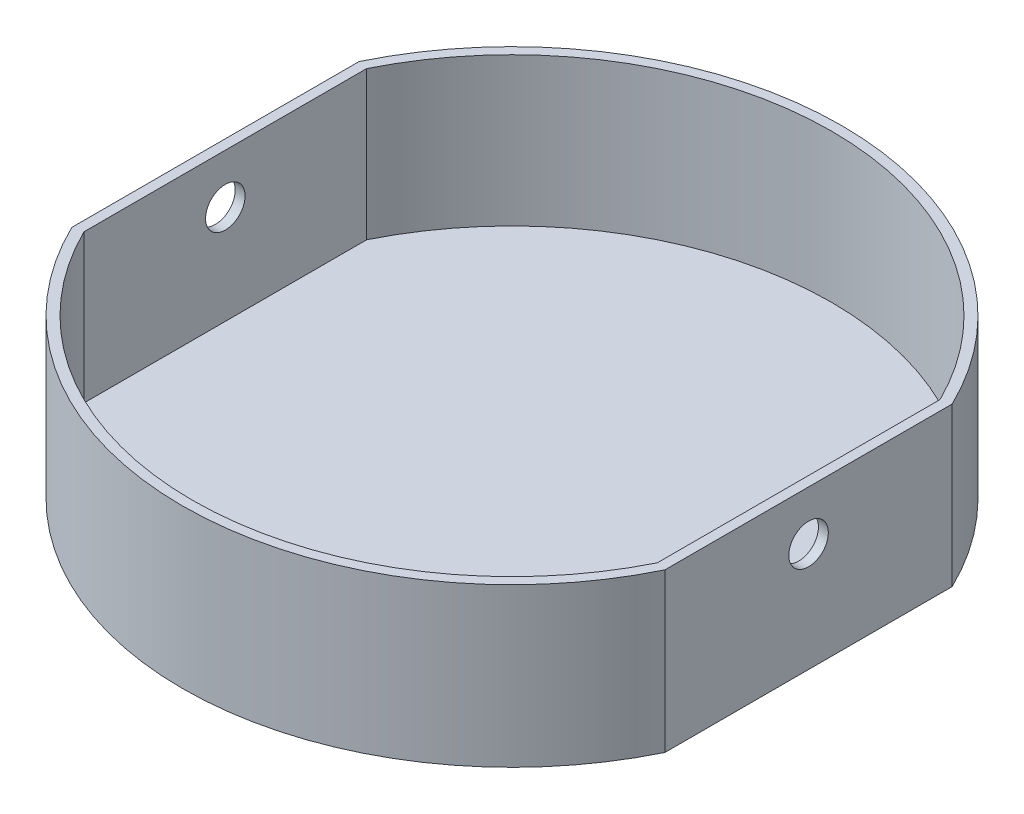
ISO-10303-21;
HEADER;
FILE_DESCRIPTION(('STEP AP214'),'2;1');
FILE_NAME('part.step','',(''),(''),'','','');
FILE_SCHEMA(('AUTOMOTIVE_DESIGN { 1 0 10303 214 1 1 1 1 }'));
ENDSEC;
DATA;
#1=APPLICATION_CONTEXT('core data for automotive mechanical design processes');
#2=APPLICATION_PROTOCOL_DEFINITION('international standard','automotive_design',2000,#1);
#3=PRODUCT_CONTEXT('',#1,'mechanical');
#4=PRODUCT('Part','Part','',(#3));
#5=PRODUCT_RELATED_PRODUCT_CATEGORY('part','',(#4));
#6=PRODUCT_DEFINITION_FORMATION('','',#4);
#7=PRODUCT_DEFINITION_CONTEXT('part definition',#1,'design');
#8=PRODUCT_DEFINITION('design','',#6,#7);
#9=PRODUCT_DEFINITION_SHAPE('','',#8);
#10=(LENGTH_UNIT() NAMED_UNIT(*) SI_UNIT(.MILLI.,.METRE.));
#11=(NAMED_UNIT(*) PLANE_ANGLE_UNIT() SI_UNIT($,.RADIAN.));
#12=(NAMED_UNIT(*) SI_UNIT($,.STERADIAN.) SOLID_ANGLE_UNIT());
#13=UNCERTAINTY_MEASURE_WITH_UNIT(LENGTH_MEASURE(1.E-05),#10,'distance_accuracy_value','');
#14=(GEOMETRIC_REPRESENTATION_CONTEXT(3) GLOBAL_UNCERTAINTY_ASSIGNED_CONTEXT((#13)) GLOBAL_UNIT_ASSIGNED_CONTEXT((#10,
#11,#12)) REPRESENTATION_CONTEXT('',''));
#15=CARTESIAN_POINT('',(0.,0.,0.));
#16=DIRECTION('',(0.,0.,1.));
#17=DIRECTION('',(1.,0.,0.));
#18=AXIS2_PLACEMENT_3D('',#15,#16,#17);
#19=CARTESIAN_POINT('',(0.,48.,0.));
#20=DIRECTION('',(0.,1.,0.));
#21=DIRECTION('',(0.,0.,1.));
#22=AXIS2_PLACEMENT_3D('',#19,#20,#21);
#23=PLANE('',#22);
#24=CARTESIAN_POINT('',(0.,48.,0.));
#25=DIRECTION('',(0.,1.,0.));
#26=DIRECTION('',(0.,0.,1.));
#27=AXIS2_PLACEMENT_3D('',#24,#25,#26);
#28=CIRCLE('',#27,100.);
#29=CARTESIAN_POINT('',(-90.0859820491556,48.,43.4110105645932));
#30=VERTEX_POINT('',#29);
#31=CARTESIAN_POINT('',(90.,48.,43.5889894354068));
#32=VERTEX_POINT('',#31);
#33=EDGE_CURVE('E208',#30,#32,#28,.T.);
#34=ORIENTED_EDGE('',*,*,#33,.T.);
#35=DIRECTION('',(0.,0.,1.));
#36=VECTOR('',#35,1.);
#37=CARTESIAN_POINT('',(90.,48.,-43.5889894354068));
#38=LINE('',#37,#36);
#39=CARTESIAN_POINT('',(90.,48.,-43.5889894354068));
#40=VERTEX_POINT('',#39);
#41=EDGE_CURVE('E232',#40,#32,#38,.T.);
#42=ORIENTED_EDGE('',*,*,#41,.F.);
#43=CARTESIAN_POINT('',(0.,48.,2.63677968348475E-13));
#44=DIRECTION('',(0.,1.,0.));
#45=DIRECTION('',(0.,0.,-1.));
#46=AXIS2_PLACEMENT_3D('',#43,#44,#45);
#47=CIRCLE('',#46,100.);
#48=CARTESIAN_POINT('',(-90.,48.,-43.5889894354068));
#49=VERTEX_POINT('',#48);
#50=EDGE_CURVE('E202',#40,#49,#47,.T.);
#51=ORIENTED_EDGE('',*,*,#50,.T.);
#52=DIRECTION('',(0.,0.,1.));
#53=VECTOR('',#52,1.);
#54=CARTESIAN_POINT('',(-90.,48.,-43.5889894354068));
#55=LINE('',#54,#53);
#56=CARTESIAN_POINT('',(-90.,48.,43.4110105645932));
#57=VERTEX_POINT('',#56);
#58=EDGE_CURVE('E225',#49,#57,#55,.T.);
#59=ORIENTED_EDGE('',*,*,#58,.T.);
#60=DIRECTION('',(-1.,0.,0.));
#61=VECTOR('',#60,1.);
#62=CARTESIAN_POINT('',(-87.,48.,43.4110105645932));
#63=LINE('',#62,#61);
#64=EDGE_CURVE('E204',#57,#30,#63,.T.);
#65=ORIENTED_EDGE('',*,*,#64,.T.);
#66=EDGE_LOOP('',(#34,#42,#51,#59,#65));
#67=FACE_BOUND('',#66,.T.);
#68=DIRECTION('',(0.,0.,1.));
#69=VECTOR('',#68,1.);
#70=CARTESIAN_POINT('',(87.,48.,-42.8952211790544));
#71=LINE('',#70,#69);
#72=CARTESIAN_POINT('',(87.,48.,-42.8952211790544));
#73=VERTEX_POINT('',#72);
#74=CARTESIAN_POINT('',(87.,48.,42.8952211790544));
#75=VERTEX_POINT('',#74);
#76=EDGE_CURVE('E199',#73,#75,#71,.T.);
#77=ORIENTED_EDGE('',*,*,#76,.T.);
#78=CARTESIAN_POINT('',(0.,48.,0.));
#79=DIRECTION('',(0.,1.,0.));
#80=DIRECTION('',(0.,0.,1.));
#81=AXIS2_PLACEMENT_3D('',#78,#79,#80);
#82=CIRCLE('',#81,97.);
#83=CARTESIAN_POINT('',(-87.,48.,42.8952211790545));
#84=VERTEX_POINT('',#83);
#85=EDGE_CURVE('E165',#84,#75,#82,.T.);
#86=ORIENTED_EDGE('',*,*,#85,.F.);
#87=DIRECTION('',(0.,0.,1.));
#88=VECTOR('',#87,1.);
#89=CARTESIAN_POINT('',(-87.,48.,-42.8952211790544));
#90=LINE('',#89,#88);
#91=CARTESIAN_POINT('',(-87.,48.,-42.8952211790544));
#92=VERTEX_POINT('',#91);
#93=EDGE_CURVE('E160',#92,#84,#90,.T.);
#94=ORIENTED_EDGE('',*,*,#93,.F.);
#95=CARTESIAN_POINT('',(0.,48.,2.63677968348475E-13));
#96=DIRECTION('',(0.,1.,0.));
#97=DIRECTION('',(0.,0.,1.));
#98=AXIS2_PLACEMENT_3D('',#95,#96,#97);
#99=CIRCLE('',#98,97.0000000000001);
#100=EDGE_CURVE('E144',#73,#92,#99,.T.);
#101=ORIENTED_EDGE('',*,*,#100,.F.);
#102=EDGE_LOOP('',(#77,#86,#94,#101));
#103=FACE_BOUND('',#102,.T.);
#104=ADVANCED_FACE('F71',(#67,#103),#23,.T.);
#105=CARTESIAN_POINT('',(0.,3.,0.));
#106=DIRECTION('',(0.,-1.,0.));
#107=DIRECTION('',(0.,0.,-1.));
#108=AXIS2_PLACEMENT_3D('',#105,#106,#107);
#109=CYLINDRICAL_SURFACE('',#108,100.);
#110=CARTESIAN_POINT('',(0.,0.,0.));
#111=DIRECTION('',(0.,1.,0.));
#112=DIRECTION('',(0.,0.,1.));
#113=AXIS2_PLACEMENT_3D('',#110,#111,#112);
#114=CIRCLE('',#113,100.);
#115=CARTESIAN_POINT('',(90.,0.,-43.5889894354068));
#116=VERTEX_POINT('',#115);
#117=CARTESIAN_POINT('',(-90.,0.,-43.5889894354068));
#118=VERTEX_POINT('',#117);
#119=EDGE_CURVE('E237',#116,#118,#114,.T.);
#120=ORIENTED_EDGE('',*,*,#119,.T.);
#121=DIRECTION('',(0.,-1.,0.));
#122=VECTOR('',#121,1.);
#123=CARTESIAN_POINT('',(-90.,48.,-43.5889894354068));
#124=LINE('',#123,#122);
#125=EDGE_CURVE('E228',#49,#118,#124,.T.);
#126=ORIENTED_EDGE('',*,*,#125,.F.);
#127=ORIENTED_EDGE('',*,*,#50,.F.);
#128=DIRECTION('',(0.,-1.,0.));
#129=VECTOR('',#128,1.);
#130=CARTESIAN_POINT('',(90.,48.,-43.5889894354068));
#131=LINE('',#130,#129);
#132=EDGE_CURVE('E235',#40,#116,#131,.T.);
#133=ORIENTED_EDGE('',*,*,#132,.T.);
#134=EDGE_LOOP('',(#120,#126,#127,#133));
#135=FACE_BOUND('',#134,.T.);
#136=ADVANCED_FACE('F258',(#135),#109,.T.);
#137=DIRECTION('',(0.,-1.,0.));
#138=VECTOR('',#137,1.);
#139=CARTESIAN_POINT('',(90.,3.,43.5889894354068));
#140=LINE('',#139,#138);
#141=CARTESIAN_POINT('',(90.,0.,43.5889894354068));
#142=VERTEX_POINT('',#141);
#143=EDGE_CURVE('E223',#142,#32,#140,.F.);
#144=ORIENTED_EDGE('',*,*,#143,.T.);
#145=ORIENTED_EDGE('',*,*,#33,.F.);
#146=DIRECTION('',(0.,-1.,0.));
#147=VECTOR('',#146,1.);
#148=CARTESIAN_POINT('',(-90.0859820491555,3.,43.4110105645932));
#149=LINE('',#148,#147);
#150=CARTESIAN_POINT('',(-90.0859820491556,0.,43.4110105645932));
#151=VERTEX_POINT('',#150);
#152=EDGE_CURVE('E221',#30,#151,#149,.T.);
#153=ORIENTED_EDGE('',*,*,#152,.T.);
#154=EDGE_CURVE('E94',#151,#142,#114,.T.);
#155=ORIENTED_EDGE('',*,*,#154,.T.);
#156=EDGE_LOOP('',(#144,#145,#153,#155));
#157=FACE_BOUND('',#156,.T.);
#158=ADVANCED_FACE('F73',(#157),#109,.T.);
#159=CARTESIAN_POINT('',(0.,0.,0.));
#160=DIRECTION('',(0.,1.,0.));
#161=DIRECTION('',(0.,0.,1.));
#162=AXIS2_PLACEMENT_3D('',#159,#160,#161);
#163=PLANE('',#162);
#164=DIRECTION('',(1.,0.,0.));
#165=VECTOR('',#164,1.);
#166=CARTESIAN_POINT('',(0.,0.,43.4110105645932));
#167=LINE('',#166,#165);
#168=CARTESIAN_POINT('',(-90.,0.,43.4110105645932));
#169=VERTEX_POINT('',#168);
#170=EDGE_CURVE('E79',#151,#169,#167,.T.);
#171=ORIENTED_EDGE('',*,*,#170,.T.);
#172=DIRECTION('',(0.,0.,-1.));
#173=VECTOR('',#172,1.);
#174=CARTESIAN_POINT('',(-90.,0.,0.));
#175=LINE('',#174,#173);
#176=EDGE_CURVE('E12',#169,#118,#175,.T.);
#177=ORIENTED_EDGE('',*,*,#176,.T.);
#178=ORIENTED_EDGE('',*,*,#119,.F.);
#179=DIRECTION('',(0.,0.,1.));
#180=VECTOR('',#179,1.);
#181=CARTESIAN_POINT('',(90.,0.,0.));
#182=LINE('',#181,#180);
#183=EDGE_CURVE('E240',#116,#142,#182,.T.);
#184=ORIENTED_EDGE('',*,*,#183,.T.);
#185=ORIENTED_EDGE('',*,*,#154,.F.);
#186=EDGE_LOOP('',(#171,#177,#178,#184,#185));
#187=FACE_BOUND('',#186,.T.);
#188=ADVANCED_FACE('F244',(#187),#163,.F.);
#189=CARTESIAN_POINT('',(90.,48.,-43.5889894354068));
#190=DIRECTION('',(1.,0.,0.));
#191=DIRECTION('',(0.,0.,-1.));
#192=AXIS2_PLACEMENT_3D('',#189,#190,#191);
#193=PLANE('',#192);
#194=CARTESIAN_POINT('',(90.,33.,0.));
#195=DIRECTION('',(1.,0.,0.));
#196=DIRECTION('',(0.,0.,-1.));
#197=AXIS2_PLACEMENT_3D('',#194,#195,#196);
#198=CIRCLE('',#197,6.);
#199=CARTESIAN_POINT('',(90.,33.,-6.00000000000001));
#200=VERTEX_POINT('',#199);
#201=EDGE_CURVE('E211',#200,#200,#198,.T.);
#202=ORIENTED_EDGE('',*,*,#201,.F.);
#203=EDGE_LOOP('',(#202));
#204=FACE_BOUND('',#203,.T.);
#205=ORIENTED_EDGE('',*,*,#41,.T.);
#206=ORIENTED_EDGE('',*,*,#143,.F.);
#207=ORIENTED_EDGE('',*,*,#183,.F.);
#208=ORIENTED_EDGE('',*,*,#132,.F.);
#209=EDGE_LOOP('',(#205,#206,#207,#208));
#210=FACE_BOUND('',#209,.T.);
#211=ADVANCED_FACE('F262',(#204,#210),#193,.T.);
#212=CARTESIAN_POINT('',(-90.,48.,-43.5889894354068));
#213=DIRECTION('',(1.,0.,0.));
#214=DIRECTION('',(0.,0.,-1.));
#215=AXIS2_PLACEMENT_3D('',#212,#213,#214);
#216=PLANE('',#215);
#217=CARTESIAN_POINT('',(-90.,33.,0.));
#218=DIRECTION('',(-1.,0.,0.));
#219=DIRECTION('',(0.,0.,1.));
#220=AXIS2_PLACEMENT_3D('',#217,#218,#219);
#221=CIRCLE('',#220,6.);
#222=CARTESIAN_POINT('',(-90.,33.,6.00000000000003));
#223=VERTEX_POINT('',#222);
#224=EDGE_CURVE('E216',#223,#223,#221,.T.);
#225=ORIENTED_EDGE('',*,*,#224,.F.);
#226=EDGE_LOOP('',(#225));
#227=FACE_BOUND('',#226,.T.);
#228=ORIENTED_EDGE('',*,*,#125,.T.);
#229=ORIENTED_EDGE('',*,*,#176,.F.);
#230=DIRECTION('',(0.,-1.,0.));
#231=VECTOR('',#230,1.);
#232=CARTESIAN_POINT('',(-90.,48.,43.4110105645932));
#233=LINE('',#232,#231);
#234=EDGE_CURVE('E230',#57,#169,#233,.T.);
#235=ORIENTED_EDGE('',*,*,#234,.F.);
#236=ORIENTED_EDGE('',*,*,#58,.F.);
#237=EDGE_LOOP('',(#228,#229,#235,#236));
#238=FACE_BOUND('',#237,.T.);
#239=ADVANCED_FACE('F256',(#227,#238),#216,.F.);
#240=CARTESIAN_POINT('',(-90.,-42.,43.4110105645932));
#241=DIRECTION('',(0.,0.,1.));
#242=DIRECTION('',(1.,0.,0.));
#243=AXIS2_PLACEMENT_3D('',#240,#241,#242);
#244=PLANE('',#243);
#245=ORIENTED_EDGE('',*,*,#152,.F.);
#246=ORIENTED_EDGE('',*,*,#64,.F.);
#247=ORIENTED_EDGE('',*,*,#234,.T.);
#248=ORIENTED_EDGE('',*,*,#170,.F.);
#249=EDGE_LOOP('',(#245,#246,#247,#248));
#250=FACE_BOUND('',#249,.T.);
#251=ADVANCED_FACE('F248',(#250),#244,.F.);
#252=CARTESIAN_POINT('',(-45.,33.,0.));
#253=DIRECTION('',(-1.,0.,0.));
#254=DIRECTION('',(0.,0.,1.));
#255=AXIS2_PLACEMENT_3D('',#252,#253,#254);
#256=CYLINDRICAL_SURFACE('',#255,6.);
#257=CARTESIAN_POINT('',(-87.,33.,0.));
#258=DIRECTION('',(1.,0.,0.));
#259=DIRECTION('',(0.,0.,-1.));
#260=AXIS2_PLACEMENT_3D('',#257,#258,#259);
#261=CIRCLE('',#260,6.);
#262=CARTESIAN_POINT('',(-87.,33.,6.00000000000003));
#263=VERTEX_POINT('',#262);
#264=EDGE_CURVE('E154',#263,#263,#261,.F.);
#265=CARTESIAN_POINT('',(-87.,33.,6.00000000000003));
#266=CARTESIAN_POINT('',(-87.03125,33.,6.00000000000003));
#267=CARTESIAN_POINT('',(-87.0625,33.,6.00000000000003));
#268=CARTESIAN_POINT('',(-87.125,33.,6.00000000000003));
#269=CARTESIAN_POINT('',(-87.15625,33.,6.00000000000003));
#270=CARTESIAN_POINT('',(-87.21875,33.,6.00000000000003));
#271=CARTESIAN_POINT('',(-87.25,33.,6.00000000000003));
#272=CARTESIAN_POINT('',(-87.3125,33.,6.00000000000003));
#273=CARTESIAN_POINT('',(-87.34375,33.,6.00000000000003));
#274=CARTESIAN_POINT('',(-87.4062499999999,33.,6.00000000000003));
#275=CARTESIAN_POINT('',(-87.4375,33.,6.00000000000003));
#276=CARTESIAN_POINT('',(-87.5,33.,6.00000000000003));
#277=CARTESIAN_POINT('',(-87.53125,33.,6.00000000000003));
#278=CARTESIAN_POINT('',(-87.59375,33.,6.00000000000003));
#279=CARTESIAN_POINT('',(-87.625,33.,6.00000000000003));
#280=CARTESIAN_POINT('',(-87.6875,33.,6.00000000000003));
#281=CARTESIAN_POINT('',(-87.71875,33.,6.00000000000003));
#282=CARTESIAN_POINT('',(-87.78125,33.,6.00000000000003));
#283=CARTESIAN_POINT('',(-87.8125,33.,6.00000000000003));
#284=CARTESIAN_POINT('',(-87.875,33.,6.00000000000003));
#285=CARTESIAN_POINT('',(-87.90625,33.,6.00000000000003));
#286=CARTESIAN_POINT('',(-87.96875,33.,6.00000000000003));
#287=CARTESIAN_POINT('',(-88.,33.,6.00000000000003));
#288=CARTESIAN_POINT('',(-88.0625,33.,6.00000000000003));
#289=CARTESIAN_POINT('',(-88.09375,33.,6.00000000000003));
#290=CARTESIAN_POINT('',(-88.15625,33.,6.00000000000003));
#291=CARTESIAN_POINT('',(-88.1875,33.,6.00000000000003));
#292=CARTESIAN_POINT('',(-88.25,33.,6.00000000000003));
#293=CARTESIAN_POINT('',(-88.28125,33.,6.00000000000003));
#294=CARTESIAN_POINT('',(-88.34375,33.,6.00000000000003));
#295=CARTESIAN_POINT('',(-88.375,33.,6.00000000000003));
#296=CARTESIAN_POINT('',(-88.4375,33.,6.00000000000003));
#297=CARTESIAN_POINT('',(-88.46875,33.,6.00000000000003));
#298=CARTESIAN_POINT('',(-88.53125,33.,6.00000000000003));
#299=CARTESIAN_POINT('',(-88.5625,33.,6.00000000000003));
#300=CARTESIAN_POINT('',(-88.625,33.,6.00000000000003));
#301=CARTESIAN_POINT('',(-88.65625,33.,6.00000000000003));
#302=CARTESIAN_POINT('',(-88.71875,33.,6.00000000000003));
#303=CARTESIAN_POINT('',(-88.75,33.,6.00000000000003));
#304=CARTESIAN_POINT('',(-88.8125,33.,6.00000000000003));
#305=CARTESIAN_POINT('',(-88.84375,33.,6.00000000000003));
#306=CARTESIAN_POINT('',(-88.90625,33.,6.00000000000003));
#307=CARTESIAN_POINT('',(-88.9375,33.,6.00000000000003));
#308=CARTESIAN_POINT('',(-89.,33.,6.00000000000003));
#309=CARTESIAN_POINT('',(-89.03125,33.,6.00000000000003));
#310=CARTESIAN_POINT('',(-89.09375,33.,6.00000000000003));
#311=CARTESIAN_POINT('',(-89.125,33.,6.00000000000003));
#312=CARTESIAN_POINT('',(-89.1875,33.,6.00000000000003));
#313=CARTESIAN_POINT('',(-89.21875,33.,6.00000000000003));
#314=CARTESIAN_POINT('',(-89.28125,33.,6.00000000000003));
#315=CARTESIAN_POINT('',(-89.3125,33.,6.00000000000003));
#316=CARTESIAN_POINT('',(-89.375,33.,6.00000000000003));
#317=CARTESIAN_POINT('',(-89.40625,33.,6.00000000000003));
#318=CARTESIAN_POINT('',(-89.46875,33.,6.00000000000003));
#319=CARTESIAN_POINT('',(-89.5,33.,6.00000000000003));
#320=CARTESIAN_POINT('',(-89.5625,33.,6.00000000000003));
#321=CARTESIAN_POINT('',(-89.59375,33.,6.00000000000003));
#322=CARTESIAN_POINT('',(-89.65625,33.,6.00000000000003));
#323=CARTESIAN_POINT('',(-89.6875,33.,6.00000000000003));
#324=CARTESIAN_POINT('',(-89.75,33.,6.00000000000003));
#325=CARTESIAN_POINT('',(-89.78125,33.,6.00000000000003));
#326=CARTESIAN_POINT('',(-89.84375,33.,6.00000000000003));
#327=CARTESIAN_POINT('',(-89.875,33.,6.00000000000003));
#328=CARTESIAN_POINT('',(-89.9375,33.,6.00000000000003));
#329=CARTESIAN_POINT('',(-89.96875,33.,6.00000000000003));
#330=CARTESIAN_POINT('',(-90.,33.,6.00000000000003));
#331=B_SPLINE_CURVE_WITH_KNOTS('',3,(#265,#266,#267,#268,#269,#270,#271,#272,#273,#274,#275,
#276,#277,#278,#279,#280,#281,#282,#283,#284,#285,#286,#287,#288,#289,#290,#291,#292,#293,#294,
#295,#296,#297,#298,#299,#300,#301,#302,#303,#304,#305,#306,#307,#308,#309,#310,#311,#312,#313,
#314,#315,#316,#317,#318,#319,#320,#321,#322,#323,#324,#325,#326,#327,#328,#329,#330),
.UNSPECIFIED.,.F.,.F.,(4,2,2,2,2,2,2,2,2,2,2,2,2,2,2,2,2,2,2,2,2,2,2,2,2,2,2,2,2,2,2,2,4),(0.,
0.0937500000000036,0.187499999999993,0.281249999999997,0.374999999999986,0.46874999999999,
0.562499999999994,0.656249999999997,0.750000000000001,0.843750000000004,0.937500000000008,
1.03125,1.125,1.21874999999999,1.31249999999999,1.40625,1.5,1.59375,1.68750000000001,
1.78125000000001,1.875,1.96875000000001,2.06249999999999,2.15625,2.25,2.34375000000001,
2.43750000000001,2.53125000000001,2.62500000000002,2.71875000000001,2.81250000000001,2.90625,
3.),.UNSPECIFIED.);
#332=EDGE_CURVE('BSEAM281',#263,#223,#331,.T.);
#333=ORIENTED_EDGE('',*,*,#264,.F.);
#334=ORIENTED_EDGE('',*,*,#224,.T.);
#335=ORIENTED_EDGE('',*,*,#332,.T.);
#336=ORIENTED_EDGE('',*,*,#332,.F.);
#337=EDGE_LOOP('',(#333,#335,#334,#336));
#338=FACE_BOUND('',#337,.T.);
#339=ADVANCED_FACE('F281',(#338),#256,.F.);
#340=CARTESIAN_POINT('',(45.,33.,0.));
#341=DIRECTION('',(1.,0.,0.));
#342=DIRECTION('',(0.,0.,-1.));
#343=AXIS2_PLACEMENT_3D('',#340,#341,#342);
#344=CYLINDRICAL_SURFACE('',#343,6.);
#345=CARTESIAN_POINT('',(87.,33.,0.));
#346=DIRECTION('',(1.,0.,0.));
#347=DIRECTION('',(0.,0.,-1.));
#348=AXIS2_PLACEMENT_3D('',#345,#346,#347);
#349=CIRCLE('',#348,6.);
#350=CARTESIAN_POINT('',(87.,33.,-6.00000000000001));
#351=VERTEX_POINT('',#350);
#352=EDGE_CURVE('E205',#351,#351,#349,.T.);
#353=CARTESIAN_POINT('',(90.,33.,-6.00000000000001));
#354=CARTESIAN_POINT('',(89.96875,33.,-6.00000000000001));
#355=CARTESIAN_POINT('',(89.9375,33.,-6.00000000000001));
#356=CARTESIAN_POINT('',(89.875,33.,-6.00000000000001));
#357=CARTESIAN_POINT('',(89.84375,33.,-6.00000000000001));
#358=CARTESIAN_POINT('',(89.78125,33.,-6.00000000000001));
#359=CARTESIAN_POINT('',(89.75,33.,-6.00000000000001));
#360=CARTESIAN_POINT('',(89.6875,33.,-6.00000000000001));
#361=CARTESIAN_POINT('',(89.65625,33.,-6.00000000000001));
#362=CARTESIAN_POINT('',(89.59375,33.,-6.00000000000001));
#363=CARTESIAN_POINT('',(89.5625,33.,-6.00000000000001));
#364=CARTESIAN_POINT('',(89.5,33.,-6.00000000000001));
#365=CARTESIAN_POINT('',(89.46875,33.,-6.00000000000001));
#366=CARTESIAN_POINT('',(89.40625,33.,-6.00000000000001));
#367=CARTESIAN_POINT('',(89.375,33.,-6.00000000000001));
#368=CARTESIAN_POINT('',(89.3125,33.,-6.00000000000001));
#369=CARTESIAN_POINT('',(89.28125,33.,-6.00000000000001));
#370=CARTESIAN_POINT('',(89.21875,33.,-6.00000000000001));
#371=CARTESIAN_POINT('',(89.1875,33.,-6.00000000000001));
#372=CARTESIAN_POINT('',(89.125,33.,-6.00000000000001));
#373=CARTESIAN_POINT('',(89.09375,33.,-6.00000000000001));
#374=CARTESIAN_POINT('',(89.03125,33.,-6.00000000000001));
#375=CARTESIAN_POINT('',(89.,33.,-6.00000000000001));
#376=CARTESIAN_POINT('',(88.9375,33.,-6.00000000000001));
#377=CARTESIAN_POINT('',(88.90625,33.,-6.00000000000001));
#378=CARTESIAN_POINT('',(88.84375,33.,-6.00000000000001));
#379=CARTESIAN_POINT('',(88.8125,33.,-6.00000000000001));
#380=CARTESIAN_POINT('',(88.75,33.,-6.00000000000001));
#381=CARTESIAN_POINT('',(88.71875,33.,-6.00000000000001));
#382=CARTESIAN_POINT('',(88.65625,33.,-6.00000000000001));
#383=CARTESIAN_POINT('',(88.625,33.,-6.00000000000001));
#384=CARTESIAN_POINT('',(88.5625,33.,-6.00000000000001));
#385=CARTESIAN_POINT('',(88.53125,33.,-6.00000000000001));
#386=CARTESIAN_POINT('',(88.46875,33.,-6.00000000000001));
#387=CARTESIAN_POINT('',(88.4375,33.,-6.00000000000001));
#388=CARTESIAN_POINT('',(88.375,33.,-6.00000000000001));
#389=CARTESIAN_POINT('',(88.34375,33.,-6.00000000000001));
#390=CARTESIAN_POINT('',(88.28125,33.,-6.00000000000001));
#391=CARTESIAN_POINT('',(88.25,33.,-6.00000000000001));
#392=CARTESIAN_POINT('',(88.1875,33.,-6.00000000000001));
#393=CARTESIAN_POINT('',(88.15625,33.,-6.00000000000001));
#394=CARTESIAN_POINT('',(88.09375,33.,-6.00000000000001));
#395=CARTESIAN_POINT('',(88.0625,33.,-6.00000000000001));
#396=CARTESIAN_POINT('',(88.,33.,-6.00000000000001));
#397=CARTESIAN_POINT('',(87.96875,33.,-6.00000000000001));
#398=CARTESIAN_POINT('',(87.90625,33.,-6.00000000000001));
#399=CARTESIAN_POINT('',(87.875,33.,-6.00000000000001));
#400=CARTESIAN_POINT('',(87.8125,33.,-6.00000000000001));
#401=CARTESIAN_POINT('',(87.78125,33.,-6.00000000000001));
#402=CARTESIAN_POINT('',(87.71875,33.,-6.00000000000001));
#403=CARTESIAN_POINT('',(87.6875,33.,-6.00000000000001));
#404=CARTESIAN_POINT('',(87.625,33.,-6.00000000000001));
#405=CARTESIAN_POINT('',(87.59375,33.,-6.00000000000001));
#406=CARTESIAN_POINT('',(87.53125,33.,-6.00000000000001));
#407=CARTESIAN_POINT('',(87.5,33.,-6.00000000000001));
#408=CARTESIAN_POINT('',(87.4375,33.,-6.00000000000001));
#409=CARTESIAN_POINT('',(87.40625,33.,-6.00000000000001));
#410=CARTESIAN_POINT('',(87.34375,33.,-6.00000000000001));
#411=CARTESIAN_POINT('',(87.3125,33.,-6.00000000000001));
#412=CARTESIAN_POINT('',(87.25,33.,-6.00000000000001));
#413=CARTESIAN_POINT('',(87.21875,33.,-6.00000000000001));
#414=CARTESIAN_POINT('',(87.15625,33.,-6.00000000000001));
#415=CARTESIAN_POINT('',(87.125,33.,-6.00000000000001));
#416=CARTESIAN_POINT('',(87.0625,33.,-6.00000000000001));
#417=CARTESIAN_POINT('',(87.03125,33.,-6.00000000000001));
#418=CARTESIAN_POINT('',(87.,33.,-6.00000000000001));
#419=B_SPLINE_CURVE_WITH_KNOTS('',3,(#353,#354,#355,#356,#357,#358,#359,#360,#361,#362,#363,
#364,#365,#366,#367,#368,#369,#370,#371,#372,#373,#374,#375,#376,#377,#378,#379,#380,#381,#382,
#383,#384,#385,#386,#387,#388,#389,#390,#391,#392,#393,#394,#395,#396,#397,#398,#399,#400,#401,
#402,#403,#404,#405,#406,#407,#408,#409,#410,#411,#412,#413,#414,#415,#416,#417,#418),
.UNSPECIFIED.,.F.,.F.,(4,2,2,2,2,2,2,2,2,2,2,2,2,2,2,2,2,2,2,2,2,2,2,2,2,2,2,2,2,2,2,2,4),(0.,
0.0937500000000036,0.187499999999993,0.281249999999997,0.374999999999986,0.46874999999999,
0.562499999999994,0.656249999999997,0.750000000000001,0.843750000000004,0.937500000000008,
1.03125,1.125,1.21874999999999,1.31249999999999,1.40625,1.5,1.59375,1.68750000000001,
1.78125000000001,1.875,1.96875000000001,2.06249999999999,2.15625,2.25,2.34375000000001,
2.43750000000001,2.53125000000001,2.62500000000002,2.71875000000001,2.81250000000001,2.90625,
3.),.UNSPECIFIED.);
#420=EDGE_CURVE('BSEAM284',#200,#351,#419,.T.);
#421=ORIENTED_EDGE('',*,*,#201,.T.);
#422=ORIENTED_EDGE('',*,*,#352,.F.);
#423=ORIENTED_EDGE('',*,*,#420,.T.);
#424=ORIENTED_EDGE('',*,*,#420,.F.);
#425=EDGE_LOOP('',(#421,#423,#422,#424));
#426=FACE_BOUND('',#425,.T.);
#427=ADVANCED_FACE('F284',(#426),#344,.F.);
#428=CARTESIAN_POINT('',(-87.,48.,-42.8952211790544));
#429=DIRECTION('',(1.,0.,0.));
#430=DIRECTION('',(0.,0.,-1.));
#431=AXIS2_PLACEMENT_3D('',#428,#429,#430);
#432=PLANE('',#431);
#433=DIRECTION('',(0.,0.,1.));
#434=VECTOR('',#433,1.);
#435=CARTESIAN_POINT('',(-87.,3.,-42.8952211790544));
#436=LINE('',#435,#434);
#437=CARTESIAN_POINT('',(-87.,3.00000000000001,-42.8952211790544));
#438=VERTEX_POINT('',#437);
#439=CARTESIAN_POINT('',(-87.,3.00000000000001,42.8952211790545));
#440=VERTEX_POINT('',#439);
#441=EDGE_CURVE('E163',#438,#440,#436,.T.);
#442=ORIENTED_EDGE('',*,*,#441,.F.);
#443=DIRECTION('',(0.,-1.,0.));
#444=VECTOR('',#443,1.);
#445=CARTESIAN_POINT('',(-87.,48.,-42.8952211790544));
#446=LINE('',#445,#444);
#447=EDGE_CURVE('E147',#92,#438,#446,.T.);
#448=ORIENTED_EDGE('',*,*,#447,.F.);
#449=ORIENTED_EDGE('',*,*,#93,.T.);
#450=DIRECTION('',(0.,-1.,0.));
#451=VECTOR('',#450,1.);
#452=CARTESIAN_POINT('',(-87.,48.,42.8952211790545));
#453=LINE('',#452,#451);
#454=EDGE_CURVE('E86',#84,#440,#453,.T.);
#455=ORIENTED_EDGE('',*,*,#454,.T.);
#456=EDGE_LOOP('',(#442,#448,#449,#455));
#457=FACE_BOUND('',#456,.T.);
#458=ORIENTED_EDGE('',*,*,#264,.T.);
#459=EDGE_LOOP('',(#458));
#460=FACE_BOUND('',#459,.T.);
#461=ADVANCED_FACE('F158',(#457,#460),#432,.T.);
#462=CARTESIAN_POINT('',(0.,3.,0.));
#463=DIRECTION('',(0.,-1.,0.));
#464=DIRECTION('',(0.,0.,-1.));
#465=AXIS2_PLACEMENT_3D('',#462,#463,#464);
#466=PLANE('',#465);
#467=CARTESIAN_POINT('',(0.,3.,2.63677968348475E-13));
#468=DIRECTION('',(0.,1.,0.));
#469=DIRECTION('',(0.,0.,1.));
#470=AXIS2_PLACEMENT_3D('',#467,#468,#469);
#471=CIRCLE('',#470,97.0000000000001);
#472=CARTESIAN_POINT('',(87.,3.00000000000001,-42.8952211790544));
#473=VERTEX_POINT('',#472);
#474=EDGE_CURVE('E155',#473,#438,#471,.T.);
#475=ORIENTED_EDGE('',*,*,#474,.T.);
#476=ORIENTED_EDGE('',*,*,#441,.T.);
#477=CARTESIAN_POINT('',(0.,3.,0.));
#478=DIRECTION('',(0.,1.,0.));
#479=DIRECTION('',(0.,0.,1.));
#480=AXIS2_PLACEMENT_3D('',#477,#478,#479);
#481=CIRCLE('',#480,97.);
#482=CARTESIAN_POINT('',(87.,3.00000000000001,42.8952211790544));
#483=VERTEX_POINT('',#482);
#484=EDGE_CURVE('E189',#440,#483,#481,.T.);
#485=ORIENTED_EDGE('',*,*,#484,.T.);
#486=DIRECTION('',(0.,0.,1.));
#487=VECTOR('',#486,1.);
#488=CARTESIAN_POINT('',(87.,3.,-42.8952211790544));
#489=LINE('',#488,#487);
#490=EDGE_CURVE('E178',#473,#483,#489,.T.);
#491=ORIENTED_EDGE('',*,*,#490,.F.);
#492=EDGE_LOOP('',(#475,#476,#485,#491));
#493=FACE_BOUND('',#492,.T.);
#494=ADVANCED_FACE('F289',(#493),#466,.F.);
#495=CARTESIAN_POINT('',(87.,48.,-42.8952211790544));
#496=DIRECTION('',(1.,0.,0.));
#497=DIRECTION('',(0.,0.,-1.));
#498=AXIS2_PLACEMENT_3D('',#495,#496,#497);
#499=PLANE('',#498);
#500=ORIENTED_EDGE('',*,*,#352,.T.);
#501=EDGE_LOOP('',(#500));
#502=FACE_BOUND('',#501,.T.);
#503=ORIENTED_EDGE('',*,*,#490,.T.);
#504=DIRECTION('',(0.,-1.,0.));
#505=VECTOR('',#504,1.);
#506=CARTESIAN_POINT('',(87.,48.,42.8952211790544));
#507=LINE('',#506,#505);
#508=EDGE_CURVE('E194',#75,#483,#507,.T.);
#509=ORIENTED_EDGE('',*,*,#508,.F.);
#510=ORIENTED_EDGE('',*,*,#76,.F.);
#511=DIRECTION('',(0.,-1.,0.));
#512=VECTOR('',#511,1.);
#513=CARTESIAN_POINT('',(87.,48.,-42.8952211790544));
#514=LINE('',#513,#512);
#515=EDGE_CURVE('E150',#73,#473,#514,.T.);
#516=ORIENTED_EDGE('',*,*,#515,.T.);
#517=EDGE_LOOP('',(#503,#509,#510,#516));
#518=FACE_BOUND('',#517,.T.);
#519=ADVANCED_FACE('F292',(#502,#518),#499,.F.);
#520=CARTESIAN_POINT('',(0.,48.,2.63677968348475E-13));
#521=DIRECTION('',(0.,-1.,0.));
#522=DIRECTION('',(0.,0.,-1.));
#523=AXIS2_PLACEMENT_3D('',#520,#521,#522);
#524=CYLINDRICAL_SURFACE('',#523,97.0000000000001);
#525=ORIENTED_EDGE('',*,*,#474,.F.);
#526=ORIENTED_EDGE('',*,*,#515,.F.);
#527=ORIENTED_EDGE('',*,*,#100,.T.);
#528=ORIENTED_EDGE('',*,*,#447,.T.);
#529=EDGE_LOOP('',(#525,#526,#527,#528));
#530=FACE_BOUND('',#529,.T.);
#531=ADVANCED_FACE('F146',(#530),#524,.F.);
#532=CARTESIAN_POINT('',(0.,48.,0.));
#533=DIRECTION('',(0.,-1.,0.));
#534=DIRECTION('',(0.,0.,-1.));
#535=AXIS2_PLACEMENT_3D('',#532,#533,#534);
#536=CYLINDRICAL_SURFACE('',#535,97.);
#537=ORIENTED_EDGE('',*,*,#484,.F.);
#538=ORIENTED_EDGE('',*,*,#454,.F.);
#539=ORIENTED_EDGE('',*,*,#85,.T.);
#540=ORIENTED_EDGE('',*,*,#508,.T.);
#541=EDGE_LOOP('',(#537,#538,#539,#540));
#542=FACE_BOUND('',#541,.T.);
#543=ADVANCED_FACE('F296',(#542),#536,.F.);
#544=CLOSED_SHELL('',(#104,#136,#158,#188,#211,#239,#251,#339,#427,#461,#494,#519,#531,#543));
#545=MANIFOLD_SOLID_BREP('B2',#544);
#546=ADVANCED_BREP_SHAPE_REPRESENTATION('',(#18,#545),#14);
#547=SHAPE_DEFINITION_REPRESENTATION(#9,#546);
ENDSEC;
END-ISO-10303-21;
